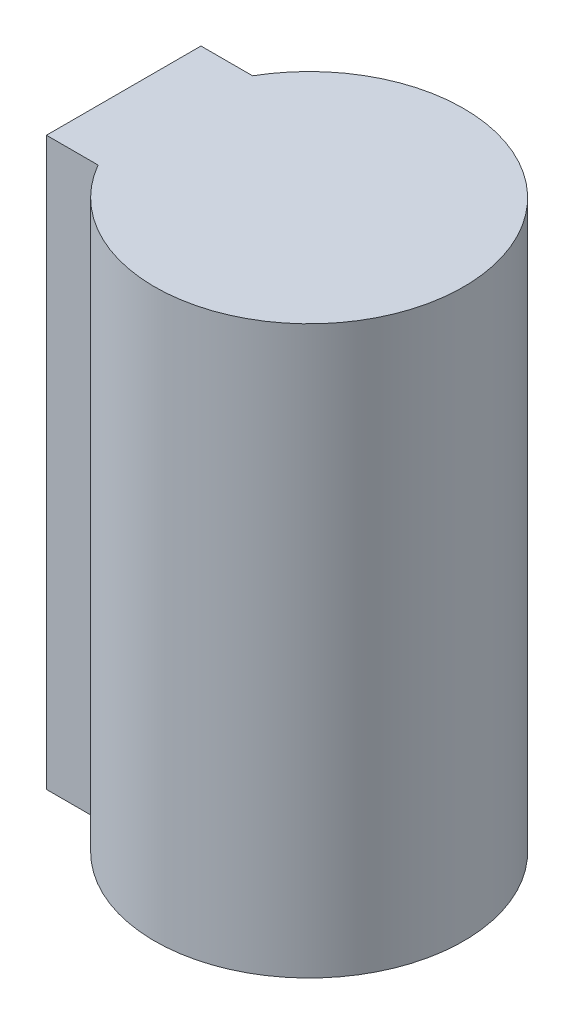
ISO-10303-21;
HEADER;
FILE_DESCRIPTION(('STEP AP214'),'2;1');
FILE_NAME('part.step','',(''),(''),'','','');
FILE_SCHEMA(('AUTOMOTIVE_DESIGN { 1 0 10303 214 1 1 1 1 }'));
ENDSEC;
DATA;
#1=APPLICATION_CONTEXT('core data for automotive mechanical design processes');
#2=APPLICATION_PROTOCOL_DEFINITION('international standard','automotive_design',2000,#1);
#3=PRODUCT_CONTEXT('',#1,'mechanical');
#4=PRODUCT('Part','Part','',(#3));
#5=PRODUCT_RELATED_PRODUCT_CATEGORY('part','',(#4));
#6=PRODUCT_DEFINITION_FORMATION('','',#4);
#7=PRODUCT_DEFINITION_CONTEXT('part definition',#1,'design');
#8=PRODUCT_DEFINITION('design','',#6,#7);
#9=PRODUCT_DEFINITION_SHAPE('','',#8);
#10=(LENGTH_UNIT() NAMED_UNIT(*) SI_UNIT(.MILLI.,.METRE.));
#11=(NAMED_UNIT(*) PLANE_ANGLE_UNIT() SI_UNIT($,.RADIAN.));
#12=(NAMED_UNIT(*) SI_UNIT($,.STERADIAN.) SOLID_ANGLE_UNIT());
#13=UNCERTAINTY_MEASURE_WITH_UNIT(LENGTH_MEASURE(1.E-05),#10,'distance_accuracy_value','');
#14=(GEOMETRIC_REPRESENTATION_CONTEXT(3) GLOBAL_UNCERTAINTY_ASSIGNED_CONTEXT((#13)) GLOBAL_UNIT_ASSIGNED_CONTEXT((#10,
#11,#12)) REPRESENTATION_CONTEXT('',''));
#15=CARTESIAN_POINT('',(0.,0.,0.));
#16=DIRECTION('',(0.,0.,1.));
#17=DIRECTION('',(1.,0.,0.));
#18=AXIS2_PLACEMENT_3D('',#15,#16,#17);
#19=CARTESIAN_POINT('',(-36.,110.,-15.));
#20=DIRECTION('',(0.,0.,1.));
#21=DIRECTION('',(1.,0.,0.));
#22=AXIS2_PLACEMENT_3D('',#19,#20,#21);
#23=PLANE('',#22);
#24=DIRECTION('',(-1.,0.,0.));
#25=VECTOR('',#24,1.);
#26=CARTESIAN_POINT('',(-36.,0.,-15.));
#27=LINE('',#26,#25);
#28=CARTESIAN_POINT('',(-25.9807621135332,0.,-15.));
#29=VERTEX_POINT('',#28);
#30=CARTESIAN_POINT('',(-36.,0.,-15.));
#31=VERTEX_POINT('',#30);
#32=EDGE_CURVE('E96',#29,#31,#27,.T.);
#33=ORIENTED_EDGE('',*,*,#32,.T.);
#34=DIRECTION('',(0.,-1.,0.));
#35=VECTOR('',#34,1.);
#36=CARTESIAN_POINT('',(-36.,110.,-15.));
#37=LINE('',#36,#35);
#38=CARTESIAN_POINT('',(-36.,110.,-15.));
#39=VERTEX_POINT('',#38);
#40=EDGE_CURVE('E11',#39,#31,#37,.T.);
#41=ORIENTED_EDGE('',*,*,#40,.F.);
#42=DIRECTION('',(-1.,0.,0.));
#43=VECTOR('',#42,1.);
#44=CARTESIAN_POINT('',(-36.,110.,-15.));
#45=LINE('',#44,#43);
#46=CARTESIAN_POINT('',(-25.9807621135332,110.,-15.));
#47=VERTEX_POINT('',#46);
#48=EDGE_CURVE('E84',#47,#39,#45,.T.);
#49=ORIENTED_EDGE('',*,*,#48,.F.);
#50=DIRECTION('',(0.,-1.,0.));
#51=VECTOR('',#50,1.);
#52=CARTESIAN_POINT('',(-25.9807621135332,110.,-15.));
#53=LINE('',#52,#51);
#54=EDGE_CURVE('E92',#47,#29,#53,.T.);
#55=ORIENTED_EDGE('',*,*,#54,.T.);
#56=EDGE_LOOP('',(#33,#41,#49,#55));
#57=FACE_BOUND('',#56,.T.);
#58=ADVANCED_FACE('F33',(#57),#23,.F.);
#59=CARTESIAN_POINT('',(-36.,110.,-15.));
#60=DIRECTION('',(1.,0.,0.));
#61=DIRECTION('',(0.,0.,-1.));
#62=AXIS2_PLACEMENT_3D('',#59,#60,#61);
#63=PLANE('',#62);
#64=DIRECTION('',(0.,0.,1.));
#65=VECTOR('',#64,1.);
#66=CARTESIAN_POINT('',(-36.,0.,-15.));
#67=LINE('',#66,#65);
#68=CARTESIAN_POINT('',(-36.,0.,15.));
#69=VERTEX_POINT('',#68);
#70=EDGE_CURVE('E88',#31,#69,#67,.T.);
#71=ORIENTED_EDGE('',*,*,#70,.T.);
#72=DIRECTION('',(0.,-1.,0.));
#73=VECTOR('',#72,1.);
#74=CARTESIAN_POINT('',(-36.,110.,15.));
#75=LINE('',#74,#73);
#76=CARTESIAN_POINT('',(-36.,110.,15.));
#77=VERTEX_POINT('',#76);
#78=EDGE_CURVE('E41',#77,#69,#75,.T.);
#79=ORIENTED_EDGE('',*,*,#78,.F.);
#80=DIRECTION('',(0.,0.,1.));
#81=VECTOR('',#80,1.);
#82=CARTESIAN_POINT('',(-36.,110.,-15.));
#83=LINE('',#82,#81);
#84=EDGE_CURVE('E79',#39,#77,#83,.T.);
#85=ORIENTED_EDGE('',*,*,#84,.F.);
#86=ORIENTED_EDGE('',*,*,#40,.T.);
#87=EDGE_LOOP('',(#71,#79,#85,#86));
#88=FACE_BOUND('',#87,.T.);
#89=ADVANCED_FACE('F87',(#88),#63,.F.);
#90=CARTESIAN_POINT('',(-36.,110.,15.));
#91=DIRECTION('',(0.,0.,-1.));
#92=DIRECTION('',(-1.,0.,0.));
#93=AXIS2_PLACEMENT_3D('',#90,#91,#92);
#94=PLANE('',#93);
#95=DIRECTION('',(1.,0.,0.));
#96=VECTOR('',#95,1.);
#97=CARTESIAN_POINT('',(-36.,0.,15.));
#98=LINE('',#97,#96);
#99=CARTESIAN_POINT('',(-25.9807621135332,0.,15.));
#100=VERTEX_POINT('',#99);
#101=EDGE_CURVE('E66',#69,#100,#98,.T.);
#102=ORIENTED_EDGE('',*,*,#101,.T.);
#103=DIRECTION('',(0.,-1.,0.));
#104=VECTOR('',#103,1.);
#105=CARTESIAN_POINT('',(-25.9807621135332,110.,15.));
#106=LINE('',#105,#104);
#107=CARTESIAN_POINT('',(-25.9807621135332,110.,15.));
#108=VERTEX_POINT('',#107);
#109=EDGE_CURVE('E89',#108,#100,#106,.T.);
#110=ORIENTED_EDGE('',*,*,#109,.F.);
#111=DIRECTION('',(1.,0.,0.));
#112=VECTOR('',#111,1.);
#113=CARTESIAN_POINT('',(-36.,110.,15.));
#114=LINE('',#113,#112);
#115=EDGE_CURVE('E82',#77,#108,#114,.T.);
#116=ORIENTED_EDGE('',*,*,#115,.F.);
#117=ORIENTED_EDGE('',*,*,#78,.T.);
#118=EDGE_LOOP('',(#102,#110,#116,#117));
#119=FACE_BOUND('',#118,.T.);
#120=ADVANCED_FACE('F90',(#119),#94,.F.);
#121=CARTESIAN_POINT('',(0.,110.,0.));
#122=DIRECTION('',(0.,-1.,0.));
#123=DIRECTION('',(0.,0.,-1.));
#124=AXIS2_PLACEMENT_3D('',#121,#122,#123);
#125=CYLINDRICAL_SURFACE('',#124,30.);
#126=CARTESIAN_POINT('',(0.,0.,0.));
#127=DIRECTION('',(0.,1.,0.));
#128=DIRECTION('',(0.,0.,1.));
#129=AXIS2_PLACEMENT_3D('',#126,#127,#128);
#130=CIRCLE('',#129,30.);
#131=EDGE_CURVE('E72',#100,#29,#130,.T.);
#132=ORIENTED_EDGE('',*,*,#131,.T.);
#133=ORIENTED_EDGE('',*,*,#54,.F.);
#134=CARTESIAN_POINT('',(0.,110.,0.));
#135=DIRECTION('',(0.,1.,0.));
#136=DIRECTION('',(0.,0.,1.));
#137=AXIS2_PLACEMENT_3D('',#134,#135,#136);
#138=CIRCLE('',#137,30.);
#139=EDGE_CURVE('E49',#108,#47,#138,.T.);
#140=ORIENTED_EDGE('',*,*,#139,.F.);
#141=ORIENTED_EDGE('',*,*,#109,.T.);
#142=EDGE_LOOP('',(#132,#133,#140,#141));
#143=FACE_BOUND('',#142,.T.);
#144=ADVANCED_FACE('F103',(#143),#125,.T.);
#145=CARTESIAN_POINT('',(0.,110.,0.));
#146=DIRECTION('',(0.,1.,0.));
#147=DIRECTION('',(0.,0.,1.));
#148=AXIS2_PLACEMENT_3D('',#145,#146,#147);
#149=PLANE('',#148);
#150=ORIENTED_EDGE('',*,*,#48,.T.);
#151=ORIENTED_EDGE('',*,*,#84,.T.);
#152=ORIENTED_EDGE('',*,*,#115,.T.);
#153=ORIENTED_EDGE('',*,*,#139,.T.);
#154=EDGE_LOOP('',(#150,#151,#152,#153));
#155=FACE_BOUND('',#154,.T.);
#156=ADVANCED_FACE('F80',(#155),#149,.T.);
#157=CARTESIAN_POINT('',(0.,0.,0.));
#158=DIRECTION('',(0.,1.,0.));
#159=DIRECTION('',(0.,0.,1.));
#160=AXIS2_PLACEMENT_3D('',#157,#158,#159);
#161=PLANE('',#160);
#162=ORIENTED_EDGE('',*,*,#32,.F.);
#163=ORIENTED_EDGE('',*,*,#131,.F.);
#164=ORIENTED_EDGE('',*,*,#101,.F.);
#165=ORIENTED_EDGE('',*,*,#70,.F.);
#166=EDGE_LOOP('',(#162,#163,#164,#165));
#167=FACE_BOUND('',#166,.T.);
#168=ADVANCED_FACE('F106',(#167),#161,.F.);
#169=CLOSED_SHELL('',(#58,#89,#120,#144,#156,#168));
#170=MANIFOLD_SOLID_BREP('B2',#169);
#171=ADVANCED_BREP_SHAPE_REPRESENTATION('',(#18,#170),#14);
#172=SHAPE_DEFINITION_REPRESENTATION(#9,#171);
ENDSEC;
END-ISO-10303-21;
